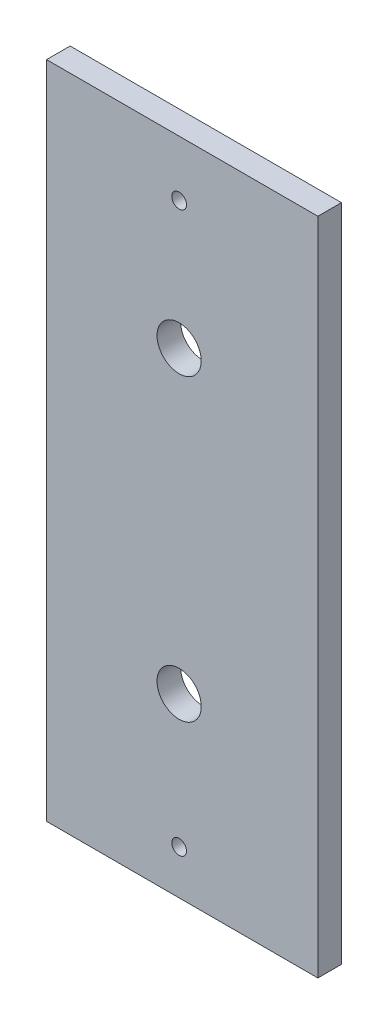
ISO-10303-21;
HEADER;
FILE_DESCRIPTION(('STEP AP214'),'2;1');
FILE_NAME('part.step','',(''),(''),'','','');
FILE_SCHEMA(('AUTOMOTIVE_DESIGN { 1 0 10303 214 1 1 1 1 }'));
ENDSEC;
DATA;
#1=APPLICATION_CONTEXT('core data for automotive mechanical design processes');
#2=APPLICATION_PROTOCOL_DEFINITION('international standard','automotive_design',2000,#1);
#3=PRODUCT_CONTEXT('',#1,'mechanical');
#4=PRODUCT('Part','Part','',(#3));
#5=PRODUCT_RELATED_PRODUCT_CATEGORY('part','',(#4));
#6=PRODUCT_DEFINITION_FORMATION('','',#4);
#7=PRODUCT_DEFINITION_CONTEXT('part definition',#1,'design');
#8=PRODUCT_DEFINITION('design','',#6,#7);
#9=PRODUCT_DEFINITION_SHAPE('','',#8);
#10=(LENGTH_UNIT() NAMED_UNIT(*) SI_UNIT(.MILLI.,.METRE.));
#11=(NAMED_UNIT(*) PLANE_ANGLE_UNIT() SI_UNIT($,.RADIAN.));
#12=(NAMED_UNIT(*) SI_UNIT($,.STERADIAN.) SOLID_ANGLE_UNIT());
#13=UNCERTAINTY_MEASURE_WITH_UNIT(LENGTH_MEASURE(1.E-05),#10,'distance_accuracy_value','');
#14=(GEOMETRIC_REPRESENTATION_CONTEXT(3) GLOBAL_UNCERTAINTY_ASSIGNED_CONTEXT((#13)) GLOBAL_UNIT_ASSIGNED_CONTEXT((#10,
#11,#12)) REPRESENTATION_CONTEXT('',''));
#15=CARTESIAN_POINT('',(0.,0.,0.));
#16=DIRECTION('',(0.,0.,1.));
#17=DIRECTION('',(1.,0.,0.));
#18=AXIS2_PLACEMENT_3D('',#15,#16,#17);
#19=CARTESIAN_POINT('',(0.,0.,1.6));
#20=DIRECTION('',(0.,0.,1.));
#21=DIRECTION('',(1.,0.,0.));
#22=AXIS2_PLACEMENT_3D('',#19,#20,#21);
#23=PLANE('',#22);
#24=CARTESIAN_POINT('',(9.,3.,1.6));
#25=DIRECTION('',(0.,0.,1.));
#26=DIRECTION('',(1.,0.,0.));
#27=AXIS2_PLACEMENT_3D('',#24,#25,#26);
#28=CIRCLE('',#27,0.5);
#29=CARTESIAN_POINT('',(9.5,3.,1.6));
#30=VERTEX_POINT('',#29);
#31=EDGE_CURVE('E121',#30,#30,#28,.T.);
#32=ORIENTED_EDGE('',*,*,#31,.F.);
#33=EDGE_LOOP('',(#32));
#34=FACE_BOUND('',#33,.T.);
#35=CARTESIAN_POINT('',(9.,41.,1.6));
#36=DIRECTION('',(0.,0.,1.));
#37=DIRECTION('',(1.,0.,0.));
#38=AXIS2_PLACEMENT_3D('',#35,#36,#37);
#39=CIRCLE('',#38,0.5);
#40=CARTESIAN_POINT('',(9.5,41.,1.6));
#41=VERTEX_POINT('',#40);
#42=EDGE_CURVE('E100',#41,#41,#39,.T.);
#43=ORIENTED_EDGE('',*,*,#42,.F.);
#44=EDGE_LOOP('',(#43));
#45=FACE_BOUND('',#44,.T.);
#46=DIRECTION('',(0.,-1.,0.));
#47=VECTOR('',#46,1.);
#48=CARTESIAN_POINT('',(0.,44.79,1.6));
#49=LINE('',#48,#47);
#50=CARTESIAN_POINT('',(0.,44.79,1.6));
#51=VERTEX_POINT('',#50);
#52=CARTESIAN_POINT('',(0.,0.,1.6));
#53=VERTEX_POINT('',#52);
#54=EDGE_CURVE('E85',#51,#53,#49,.T.);
#55=ORIENTED_EDGE('',*,*,#54,.T.);
#56=DIRECTION('',(1.,0.,0.));
#57=VECTOR('',#56,1.);
#58=CARTESIAN_POINT('',(0.,0.,1.6));
#59=LINE('',#58,#57);
#60=CARTESIAN_POINT('',(18.42,0.,1.6));
#61=VERTEX_POINT('',#60);
#62=EDGE_CURVE('E80',#53,#61,#59,.T.);
#63=ORIENTED_EDGE('',*,*,#62,.T.);
#64=DIRECTION('',(0.,1.,0.));
#65=VECTOR('',#64,1.);
#66=CARTESIAN_POINT('',(18.42,0.,1.6));
#67=LINE('',#66,#65);
#68=CARTESIAN_POINT('',(18.42,44.79,1.6));
#69=VERTEX_POINT('',#68);
#70=EDGE_CURVE('E83',#61,#69,#67,.T.);
#71=ORIENTED_EDGE('',*,*,#70,.T.);
#72=DIRECTION('',(-1.,0.,0.));
#73=VECTOR('',#72,1.);
#74=CARTESIAN_POINT('',(18.42,44.79,1.6));
#75=LINE('',#74,#73);
#76=EDGE_CURVE('E50',#69,#51,#75,.T.);
#77=ORIENTED_EDGE('',*,*,#76,.T.);
#78=EDGE_LOOP('',(#55,#63,#71,#77));
#79=FACE_BOUND('',#78,.T.);
#80=CARTESIAN_POINT('',(9.,32.32,1.6));
#81=DIRECTION('',(0.,0.,1.));
#82=DIRECTION('',(1.,0.,0.));
#83=AXIS2_PLACEMENT_3D('',#80,#81,#82);
#84=CIRCLE('',#83,1.5);
#85=CARTESIAN_POINT('',(10.5,32.32,1.6));
#86=VERTEX_POINT('',#85);
#87=EDGE_CURVE('E115',#86,#86,#84,.T.);
#88=ORIENTED_EDGE('',*,*,#87,.F.);
#89=EDGE_LOOP('',(#88));
#90=FACE_BOUND('',#89,.T.);
#91=CARTESIAN_POINT('',(9.,12.,1.6));
#92=DIRECTION('',(0.,0.,1.));
#93=DIRECTION('',(1.,0.,0.));
#94=AXIS2_PLACEMENT_3D('',#91,#92,#93);
#95=CIRCLE('',#94,1.5);
#96=CARTESIAN_POINT('',(10.5,12.,1.6));
#97=VERTEX_POINT('',#96);
#98=EDGE_CURVE('E127',#97,#97,#95,.T.);
#99=ORIENTED_EDGE('',*,*,#98,.F.);
#100=EDGE_LOOP('',(#99));
#101=FACE_BOUND('',#100,.T.);
#102=ADVANCED_FACE('F33',(#34,#45,#79,#90,#101),#23,.T.);
#103=CARTESIAN_POINT('',(0.,0.,0.));
#104=DIRECTION('',(0.,0.,1.));
#105=DIRECTION('',(1.,0.,0.));
#106=AXIS2_PLACEMENT_3D('',#103,#104,#105);
#107=PLANE('',#106);
#108=DIRECTION('',(0.,-1.,0.));
#109=VECTOR('',#108,1.);
#110=CARTESIAN_POINT('',(0.,44.79,0.));
#111=LINE('',#110,#109);
#112=CARTESIAN_POINT('',(0.,44.79,0.));
#113=VERTEX_POINT('',#112);
#114=CARTESIAN_POINT('',(0.,0.,0.));
#115=VERTEX_POINT('',#114);
#116=EDGE_CURVE('E97',#113,#115,#111,.T.);
#117=ORIENTED_EDGE('',*,*,#116,.F.);
#118=DIRECTION('',(-1.,0.,0.));
#119=VECTOR('',#118,1.);
#120=CARTESIAN_POINT('',(18.42,44.79,0.));
#121=LINE('',#120,#119);
#122=CARTESIAN_POINT('',(18.42,44.79,0.));
#123=VERTEX_POINT('',#122);
#124=EDGE_CURVE('E73',#123,#113,#121,.T.);
#125=ORIENTED_EDGE('',*,*,#124,.F.);
#126=DIRECTION('',(0.,1.,0.));
#127=VECTOR('',#126,1.);
#128=CARTESIAN_POINT('',(18.42,0.,0.));
#129=LINE('',#128,#127);
#130=CARTESIAN_POINT('',(18.42,0.,0.));
#131=VERTEX_POINT('',#130);
#132=EDGE_CURVE('E67',#131,#123,#129,.T.);
#133=ORIENTED_EDGE('',*,*,#132,.F.);
#134=DIRECTION('',(1.,0.,0.));
#135=VECTOR('',#134,1.);
#136=CARTESIAN_POINT('',(0.,0.,0.));
#137=LINE('',#136,#135);
#138=EDGE_CURVE('E89',#115,#131,#137,.T.);
#139=ORIENTED_EDGE('',*,*,#138,.F.);
#140=EDGE_LOOP('',(#117,#125,#133,#139));
#141=FACE_BOUND('',#140,.T.);
#142=CARTESIAN_POINT('',(9.,41.,0.));
#143=DIRECTION('',(0.,0.,1.));
#144=DIRECTION('',(1.,0.,0.));
#145=AXIS2_PLACEMENT_3D('',#142,#143,#144);
#146=CIRCLE('',#145,0.5);
#147=CARTESIAN_POINT('',(9.5,41.,0.));
#148=VERTEX_POINT('',#147);
#149=EDGE_CURVE('E112',#148,#148,#146,.T.);
#150=ORIENTED_EDGE('',*,*,#149,.T.);
#151=EDGE_LOOP('',(#150));
#152=FACE_BOUND('',#151,.T.);
#153=CARTESIAN_POINT('',(9.,32.32,0.));
#154=DIRECTION('',(0.,0.,1.));
#155=DIRECTION('',(1.,0.,0.));
#156=AXIS2_PLACEMENT_3D('',#153,#154,#155);
#157=CIRCLE('',#156,1.5);
#158=CARTESIAN_POINT('',(10.5,32.32,0.));
#159=VERTEX_POINT('',#158);
#160=EDGE_CURVE('E118',#159,#159,#157,.T.);
#161=ORIENTED_EDGE('',*,*,#160,.T.);
#162=EDGE_LOOP('',(#161));
#163=FACE_BOUND('',#162,.T.);
#164=CARTESIAN_POINT('',(9.,3.,0.));
#165=DIRECTION('',(0.,0.,1.));
#166=DIRECTION('',(1.,0.,0.));
#167=AXIS2_PLACEMENT_3D('',#164,#165,#166);
#168=CIRCLE('',#167,0.5);
#169=CARTESIAN_POINT('',(9.5,3.,0.));
#170=VERTEX_POINT('',#169);
#171=EDGE_CURVE('E124',#170,#170,#168,.T.);
#172=ORIENTED_EDGE('',*,*,#171,.T.);
#173=EDGE_LOOP('',(#172));
#174=FACE_BOUND('',#173,.T.);
#175=CARTESIAN_POINT('',(9.,12.,0.));
#176=DIRECTION('',(0.,0.,1.));
#177=DIRECTION('',(1.,0.,0.));
#178=AXIS2_PLACEMENT_3D('',#175,#176,#177);
#179=CIRCLE('',#178,1.5);
#180=CARTESIAN_POINT('',(10.5,12.,0.));
#181=VERTEX_POINT('',#180);
#182=EDGE_CURVE('E130',#181,#181,#179,.T.);
#183=ORIENTED_EDGE('',*,*,#182,.T.);
#184=EDGE_LOOP('',(#183));
#185=FACE_BOUND('',#184,.T.);
#186=ADVANCED_FACE('F108',(#141,#152,#163,#174,#185),#107,.F.);
#187=CARTESIAN_POINT('',(0.,44.79,1.6));
#188=DIRECTION('',(1.,0.,0.));
#189=DIRECTION('',(0.,0.,-1.));
#190=AXIS2_PLACEMENT_3D('',#187,#188,#189);
#191=PLANE('',#190);
#192=ORIENTED_EDGE('',*,*,#116,.T.);
#193=DIRECTION('',(0.,0.,-1.));
#194=VECTOR('',#193,1.);
#195=CARTESIAN_POINT('',(0.,0.,1.6));
#196=LINE('',#195,#194);
#197=EDGE_CURVE('E11',#53,#115,#196,.T.);
#198=ORIENTED_EDGE('',*,*,#197,.F.);
#199=ORIENTED_EDGE('',*,*,#54,.F.);
#200=DIRECTION('',(0.,0.,-1.));
#201=VECTOR('',#200,1.);
#202=CARTESIAN_POINT('',(0.,44.79,1.6));
#203=LINE('',#202,#201);
#204=EDGE_CURVE('E93',#51,#113,#203,.T.);
#205=ORIENTED_EDGE('',*,*,#204,.T.);
#206=EDGE_LOOP('',(#192,#198,#199,#205));
#207=FACE_BOUND('',#206,.T.);
#208=ADVANCED_FACE('F35',(#207),#191,.F.);
#209=CARTESIAN_POINT('',(0.,0.,1.6));
#210=DIRECTION('',(0.,1.,0.));
#211=DIRECTION('',(0.,0.,1.));
#212=AXIS2_PLACEMENT_3D('',#209,#210,#211);
#213=PLANE('',#212);
#214=ORIENTED_EDGE('',*,*,#138,.T.);
#215=DIRECTION('',(0.,0.,-1.));
#216=VECTOR('',#215,1.);
#217=CARTESIAN_POINT('',(18.42,0.,1.6));
#218=LINE('',#217,#216);
#219=EDGE_CURVE('E42',#61,#131,#218,.T.);
#220=ORIENTED_EDGE('',*,*,#219,.F.);
#221=ORIENTED_EDGE('',*,*,#62,.F.);
#222=ORIENTED_EDGE('',*,*,#197,.T.);
#223=EDGE_LOOP('',(#214,#220,#221,#222));
#224=FACE_BOUND('',#223,.T.);
#225=ADVANCED_FACE('F88',(#224),#213,.F.);
#226=CARTESIAN_POINT('',(18.42,0.,1.6));
#227=DIRECTION('',(-1.,0.,0.));
#228=DIRECTION('',(0.,0.,1.));
#229=AXIS2_PLACEMENT_3D('',#226,#227,#228);
#230=PLANE('',#229);
#231=ORIENTED_EDGE('',*,*,#132,.T.);
#232=DIRECTION('',(0.,0.,-1.));
#233=VECTOR('',#232,1.);
#234=CARTESIAN_POINT('',(18.42,44.79,1.6));
#235=LINE('',#234,#233);
#236=EDGE_CURVE('E90',#69,#123,#235,.T.);
#237=ORIENTED_EDGE('',*,*,#236,.F.);
#238=ORIENTED_EDGE('',*,*,#70,.F.);
#239=ORIENTED_EDGE('',*,*,#219,.T.);
#240=EDGE_LOOP('',(#231,#237,#238,#239));
#241=FACE_BOUND('',#240,.T.);
#242=ADVANCED_FACE('F91',(#241),#230,.F.);
#243=CARTESIAN_POINT('',(18.42,44.79,1.6));
#244=DIRECTION('',(0.,-1.,0.));
#245=DIRECTION('',(0.,0.,-1.));
#246=AXIS2_PLACEMENT_3D('',#243,#244,#245);
#247=PLANE('',#246);
#248=ORIENTED_EDGE('',*,*,#124,.T.);
#249=ORIENTED_EDGE('',*,*,#204,.F.);
#250=ORIENTED_EDGE('',*,*,#76,.F.);
#251=ORIENTED_EDGE('',*,*,#236,.T.);
#252=EDGE_LOOP('',(#248,#249,#250,#251));
#253=FACE_BOUND('',#252,.T.);
#254=ADVANCED_FACE('F105',(#253),#247,.F.);
#255=CARTESIAN_POINT('',(9.,41.,1.6));
#256=DIRECTION('',(0.,0.,-1.));
#257=DIRECTION('',(-1.,0.,0.));
#258=AXIS2_PLACEMENT_3D('',#255,#256,#257);
#259=CYLINDRICAL_SURFACE('',#258,0.5);
#260=ORIENTED_EDGE('',*,*,#42,.T.);
#261=EDGE_LOOP('',(#260));
#262=FACE_BOUND('',#261,.T.);
#263=ORIENTED_EDGE('',*,*,#149,.F.);
#264=EDGE_LOOP('',(#263));
#265=FACE_BOUND('',#264,.T.);
#266=ADVANCED_FACE('F149',(#262,#265),#259,.F.);
#267=CARTESIAN_POINT('',(9.,32.32,1.6));
#268=DIRECTION('',(0.,0.,-1.));
#269=DIRECTION('',(-1.,0.,0.));
#270=AXIS2_PLACEMENT_3D('',#267,#268,#269);
#271=CYLINDRICAL_SURFACE('',#270,1.5);
#272=ORIENTED_EDGE('',*,*,#87,.T.);
#273=EDGE_LOOP('',(#272));
#274=FACE_BOUND('',#273,.T.);
#275=ORIENTED_EDGE('',*,*,#160,.F.);
#276=EDGE_LOOP('',(#275));
#277=FACE_BOUND('',#276,.T.);
#278=ADVANCED_FACE('F195',(#274,#277),#271,.F.);
#279=CARTESIAN_POINT('',(9.,3.,1.6));
#280=DIRECTION('',(0.,0.,-1.));
#281=DIRECTION('',(-1.,0.,0.));
#282=AXIS2_PLACEMENT_3D('',#279,#280,#281);
#283=CYLINDRICAL_SURFACE('',#282,0.5);
#284=ORIENTED_EDGE('',*,*,#31,.T.);
#285=EDGE_LOOP('',(#284));
#286=FACE_BOUND('',#285,.T.);
#287=ORIENTED_EDGE('',*,*,#171,.F.);
#288=EDGE_LOOP('',(#287));
#289=FACE_BOUND('',#288,.T.);
#290=ADVANCED_FACE('F203',(#286,#289),#283,.F.);
#291=CARTESIAN_POINT('',(9.,12.,1.6));
#292=DIRECTION('',(0.,0.,-1.));
#293=DIRECTION('',(-1.,0.,0.));
#294=AXIS2_PLACEMENT_3D('',#291,#292,#293);
#295=CYLINDRICAL_SURFACE('',#294,1.5);
#296=ORIENTED_EDGE('',*,*,#98,.T.);
#297=EDGE_LOOP('',(#296));
#298=FACE_BOUND('',#297,.T.);
#299=ORIENTED_EDGE('',*,*,#182,.F.);
#300=EDGE_LOOP('',(#299));
#301=FACE_BOUND('',#300,.T.);
#302=ADVANCED_FACE('F136',(#298,#301),#295,.F.);
#303=CLOSED_SHELL('',(#102,#186,#208,#225,#242,#254,#266,#278,#290,#302));
#304=MANIFOLD_SOLID_BREP('B2',#303);
#305=ADVANCED_BREP_SHAPE_REPRESENTATION('',(#18,#304),#14);
#306=SHAPE_DEFINITION_REPRESENTATION(#9,#305);
ENDSEC;
END-ISO-10303-21;
